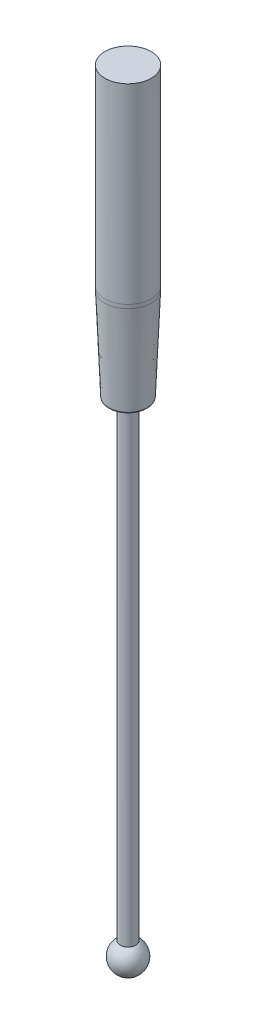
ISO-10303-21;
HEADER;
FILE_DESCRIPTION(('STEP AP214'),'2;1');
FILE_NAME('part.step','',(''),(''),'','','');
FILE_SCHEMA(('AUTOMOTIVE_DESIGN { 1 0 10303 214 1 1 1 1 }'));
ENDSEC;
DATA;
#1=APPLICATION_CONTEXT('core data for automotive mechanical design processes');
#2=APPLICATION_PROTOCOL_DEFINITION('international standard','automotive_design',2000,#1);
#3=PRODUCT_CONTEXT('',#1,'mechanical');
#4=PRODUCT('Part','Part','',(#3));
#5=PRODUCT_RELATED_PRODUCT_CATEGORY('part','',(#4));
#6=PRODUCT_DEFINITION_FORMATION('','',#4);
#7=PRODUCT_DEFINITION_CONTEXT('part definition',#1,'design');
#8=PRODUCT_DEFINITION('design','',#6,#7);
#9=PRODUCT_DEFINITION_SHAPE('','',#8);
#10=(LENGTH_UNIT() NAMED_UNIT(*) SI_UNIT(.MILLI.,.METRE.));
#11=(NAMED_UNIT(*) PLANE_ANGLE_UNIT() SI_UNIT($,.RADIAN.));
#12=(NAMED_UNIT(*) SI_UNIT($,.STERADIAN.) SOLID_ANGLE_UNIT());
#13=UNCERTAINTY_MEASURE_WITH_UNIT(LENGTH_MEASURE(1.E-05),#10,'distance_accuracy_value','');
#14=(GEOMETRIC_REPRESENTATION_CONTEXT(3) GLOBAL_UNCERTAINTY_ASSIGNED_CONTEXT((#13)) GLOBAL_UNIT_ASSIGNED_CONTEXT((#10,
#11,#12)) REPRESENTATION_CONTEXT('',''));
#15=CARTESIAN_POINT('',(0.,0.,0.));
#16=DIRECTION('',(0.,0.,1.));
#17=DIRECTION('',(1.,0.,0.));
#18=AXIS2_PLACEMENT_3D('',#15,#16,#17);
#19=CARTESIAN_POINT('',(0.,-50.,0.));
#20=DIRECTION('',(0.,-1.,0.));
#21=DIRECTION('',(-1.,0.,0.));
#22=AXIS2_PLACEMENT_3D('',#19,#20,#21);
#23=SPHERICAL_SURFACE('',#22,1.);
#24=CARTESIAN_POINT('',(1.68541767169946E-13,-49.1339745962156,0.));
#25=DIRECTION('',(0.,-1.,0.));
#26=DIRECTION('',(1.,0.,0.));
#27=AXIS2_PLACEMENT_3D('',#24,#25,#26);
#28=CIRCLE('',#27,0.499999999999834);
#29=CARTESIAN_POINT('',(0.500000000000002,-49.1339745962156,0.));
#30=VERTEX_POINT('',#29);
#31=EDGE_CURVE('E63',#30,#30,#28,.T.);
#32=ORIENTED_EDGE('',*,*,#31,.T.);
#33=EDGE_LOOP('',(#32));
#34=FACE_BOUND('',#33,.T.);
#35=ADVANCED_FACE('F43',(#34),#23,.T.);
#36=CARTESIAN_POINT('',(5.40227101012261E-12,-1574.89179703205,0.));
#37=DIRECTION('',(0.,-1.,0.));
#38=DIRECTION('',(1.,0.,0.));
#39=AXIS2_PLACEMENT_3D('',#36,#37,#38);
#40=CYLINDRICAL_SURFACE('',#39,0.499999999999884);
#41=CARTESIAN_POINT('',(0.,-18.6820201188564,0.));
#42=DIRECTION('',(0.,-1.,0.));
#43=DIRECTION('',(1.,0.,0.));
#44=AXIS2_PLACEMENT_3D('',#41,#42,#43);
#45=CIRCLE('',#44,0.499999999999935);
#46=CARTESIAN_POINT('',(0.499999999999999,-18.6820201188564,0.));
#47=VERTEX_POINT('',#46);
#48=EDGE_CURVE('E66',#47,#47,#45,.T.);
#49=ORIENTED_EDGE('',*,*,#48,.T.);
#50=EDGE_LOOP('',(#49));
#51=FACE_BOUND('',#50,.T.);
#52=ORIENTED_EDGE('',*,*,#31,.F.);
#53=EDGE_LOOP('',(#52));
#54=FACE_BOUND('',#53,.T.);
#55=ADVANCED_FACE('F89',(#51,#54),#40,.T.);
#56=CARTESIAN_POINT('',(1.2500000000053,-18.6820201188564,0.));
#57=DIRECTION('',(0.,-1.,0.));
#58=DIRECTION('',(1.,0.,0.));
#59=AXIS2_PLACEMENT_3D('',#56,#57,#58);
#60=PLANE('',#59);
#61=CARTESIAN_POINT('',(0.,-18.6820201188564,0.));
#62=DIRECTION('',(0.,-1.,0.));
#63=DIRECTION('',(1.,0.,0.));
#64=AXIS2_PLACEMENT_3D('',#61,#62,#63);
#65=CIRCLE('',#64,1.1539622498584);
#66=CARTESIAN_POINT('',(1.15396224985846,-18.6820201188564,0.));
#67=VERTEX_POINT('',#66);
#68=EDGE_CURVE('E58',#67,#67,#65,.T.);
#69=ORIENTED_EDGE('',*,*,#68,.T.);
#70=EDGE_LOOP('',(#69));
#71=FACE_BOUND('',#70,.T.);
#72=ORIENTED_EDGE('',*,*,#48,.F.);
#73=EDGE_LOOP('',(#72));
#74=FACE_BOUND('',#73,.T.);
#75=ADVANCED_FACE('F95',(#71,#74),#60,.T.);
#76=CARTESIAN_POINT('',(0.,-18.6820201188564,0.));
#77=DIRECTION('',(0.,1.,0.));
#78=DIRECTION('',(-1.,0.,0.));
#79=AXIS2_PLACEMENT_3D('',#76,#77,#78);
#80=CONICAL_SURFACE('',#79,1.25000000000523,0.0404178321863666);
#81=CARTESIAN_POINT('',(0.,-12.6211709659825,0.));
#82=DIRECTION('',(0.,-1.,0.));
#83=DIRECTION('',(1.,0.,0.));
#84=AXIS2_PLACEMENT_3D('',#81,#82,#83);
#85=CIRCLE('',#84,1.4950998636509);
#86=CARTESIAN_POINT('',(1.49509986365095,-12.6211709659825,0.));
#87=VERTEX_POINT('',#86);
#88=EDGE_CURVE('E50',#87,#87,#85,.T.);
#89=ORIENTED_EDGE('',*,*,#88,.T.);
#90=EDGE_LOOP('',(#89));
#91=FACE_BOUND('',#90,.T.);
#92=CARTESIAN_POINT('',(0.,-18.5860608017213,0.));
#93=DIRECTION('',(0.,-1.,0.));
#94=DIRECTION('',(1.,0.,0.));
#95=AXIS2_PLACEMENT_3D('',#92,#93,#94);
#96=CIRCLE('',#95,1.25388058091925);
#97=CARTESIAN_POINT('',(1.25388058091931,-18.5860608017213,0.));
#98=VERTEX_POINT('',#97);
#99=EDGE_CURVE('E54',#98,#98,#96,.F.);
#100=ORIENTED_EDGE('',*,*,#99,.T.);
#101=EDGE_LOOP('',(#100));
#102=FACE_BOUND('',#101,.T.);
#103=ADVANCED_FACE('F86',(#91,#102),#80,.T.);
#104=CARTESIAN_POINT('',(5.40227101012261E-12,-1574.89179703205,0.));
#105=DIRECTION('',(0.,-1.,0.));
#106=DIRECTION('',(1.,0.,0.));
#107=AXIS2_PLACEMENT_3D('',#104,#105,#106);
#108=CYLINDRICAL_SURFACE('',#107,1.49999999999998);
#109=CARTESIAN_POINT('',(0.,-12.378729994089,0.));
#110=DIRECTION('',(0.,1.,0.));
#111=DIRECTION('',(-1.,0.,0.));
#112=AXIS2_PLACEMENT_3D('',#109,#110,#111);
#113=CIRCLE('',#112,1.49999999999998);
#114=CARTESIAN_POINT('',(-1.49999999999994,-12.378729994089,0.));
#115=VERTEX_POINT('',#114);
#116=EDGE_CURVE('E10',#115,#115,#113,.T.);
#117=ORIENTED_EDGE('',*,*,#116,.T.);
#118=EDGE_LOOP('',(#117));
#119=FACE_BOUND('',#118,.T.);
#120=CARTESIAN_POINT('',(0.,0.,0.));
#121=DIRECTION('',(0.,-1.,0.));
#122=DIRECTION('',(1.,0.,0.));
#123=AXIS2_PLACEMENT_3D('',#120,#121,#122);
#124=CIRCLE('',#123,1.5);
#125=CARTESIAN_POINT('',(1.5,0.,0.));
#126=VERTEX_POINT('',#125);
#127=EDGE_CURVE('E69',#126,#126,#124,.T.);
#128=ORIENTED_EDGE('',*,*,#127,.T.);
#129=EDGE_LOOP('',(#128));
#130=FACE_BOUND('',#129,.T.);
#131=ADVANCED_FACE('F73',(#119,#130),#108,.T.);
#132=CARTESIAN_POINT('',(0.,0.,0.));
#133=DIRECTION('',(0.,1.,0.));
#134=DIRECTION('',(-1.,0.,0.));
#135=AXIS2_PLACEMENT_3D('',#132,#133,#134);
#136=PLANE('',#135);
#137=ORIENTED_EDGE('',*,*,#127,.F.);
#138=EDGE_LOOP('',(#137));
#139=FACE_BOUND('',#138,.T.);
#140=ADVANCED_FACE('F75',(#139),#136,.T.);
#141=CARTESIAN_POINT('',(0.,-18.5820201188565,0.));
#142=DIRECTION('',(0.,-1.,0.));
#143=DIRECTION('',(1.,0.,0.));
#144=AXIS2_PLACEMENT_3D('',#141,#142,#143);
#145=TOROIDAL_SURFACE('',#144,1.1539622498584,0.1);
#146=ORIENTED_EDGE('',*,*,#99,.F.);
#147=EDGE_LOOP('',(#146));
#148=FACE_BOUND('',#147,.T.);
#149=ORIENTED_EDGE('',*,*,#68,.F.);
#150=EDGE_LOOP('',(#149));
#151=FACE_BOUND('',#150,.T.);
#152=ADVANCED_FACE('F77',(#148,#151),#145,.T.);
#153=CARTESIAN_POINT('',(0.,-12.378729994089,0.));
#154=DIRECTION('',(0.,1.,0.));
#155=DIRECTION('',(-1.,0.,0.));
#156=AXIS2_PLACEMENT_3D('',#153,#154,#155);
#157=DEGENERATE_TOROIDAL_SURFACE('',#156,4.50000000000002,6.,.F.);
#158=ORIENTED_EDGE('',*,*,#116,.F.);
#159=EDGE_LOOP('',(#158));
#160=FACE_BOUND('',#159,.T.);
#161=ORIENTED_EDGE('',*,*,#88,.F.);
#162=EDGE_LOOP('',(#161));
#163=FACE_BOUND('',#162,.T.);
#164=ADVANCED_FACE('F45',(#160,#163),#157,.F.);
#165=CLOSED_SHELL('',(#35,#55,#75,#103,#131,#140,#152,#164));
#166=MANIFOLD_SOLID_BREP('B2',#165);
#167=ADVANCED_BREP_SHAPE_REPRESENTATION('',(#18,#166),#14);
#168=SHAPE_DEFINITION_REPRESENTATION(#9,#167);
ENDSEC;
END-ISO-10303-21;
